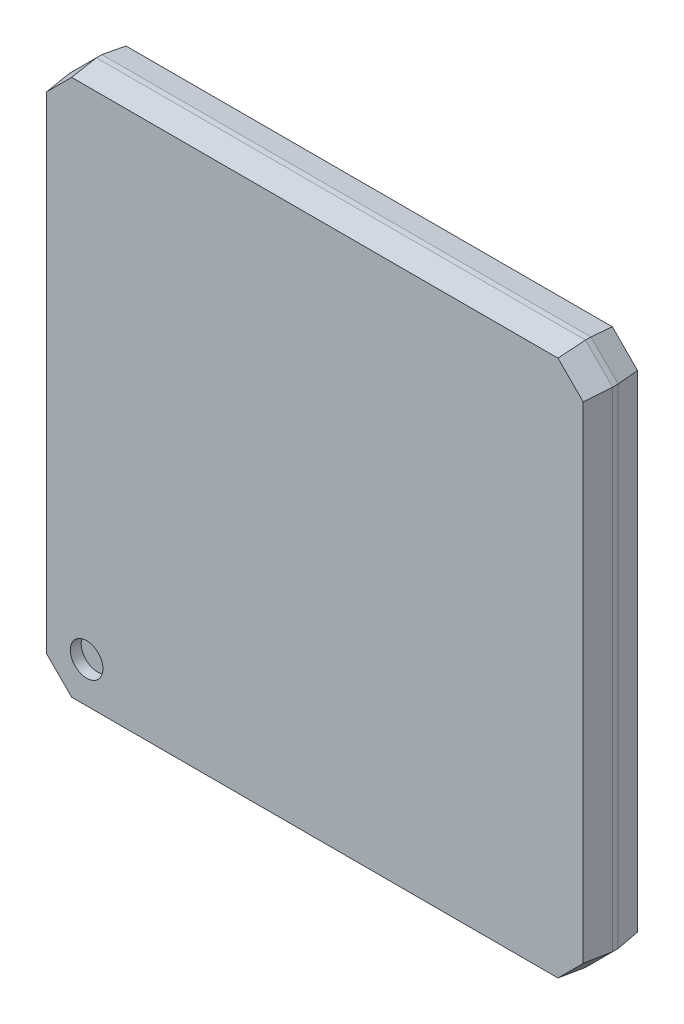
ISO-10303-21;
HEADER;
FILE_DESCRIPTION(('STEP AP214'),'2;1');
FILE_NAME('part.step','',(''),(''),'','','');
FILE_SCHEMA(('AUTOMOTIVE_DESIGN { 1 0 10303 214 1 1 1 1 }'));
ENDSEC;
DATA;
#1=APPLICATION_CONTEXT('core data for automotive mechanical design processes');
#2=APPLICATION_PROTOCOL_DEFINITION('international standard','automotive_design',2000,#1);
#3=PRODUCT_CONTEXT('',#1,'mechanical');
#4=PRODUCT('Part','Part','',(#3));
#5=PRODUCT_RELATED_PRODUCT_CATEGORY('part','',(#4));
#6=PRODUCT_DEFINITION_FORMATION('','',#4);
#7=PRODUCT_DEFINITION_CONTEXT('part definition',#1,'design');
#8=PRODUCT_DEFINITION('design','',#6,#7);
#9=PRODUCT_DEFINITION_SHAPE('','',#8);
#10=(LENGTH_UNIT() NAMED_UNIT(*) SI_UNIT(.MILLI.,.METRE.));
#11=(NAMED_UNIT(*) PLANE_ANGLE_UNIT() SI_UNIT($,.RADIAN.));
#12=(NAMED_UNIT(*) SI_UNIT($,.STERADIAN.) SOLID_ANGLE_UNIT());
#13=UNCERTAINTY_MEASURE_WITH_UNIT(LENGTH_MEASURE(1.E-05),#10,'distance_accuracy_value','');
#14=(GEOMETRIC_REPRESENTATION_CONTEXT(3) GLOBAL_UNCERTAINTY_ASSIGNED_CONTEXT((#13)) GLOBAL_UNIT_ASSIGNED_CONTEXT((#10,
#11,#12)) REPRESENTATION_CONTEXT('',''));
#15=CARTESIAN_POINT('',(0.,0.,0.));
#16=DIRECTION('',(0.,0.,1.));
#17=DIRECTION('',(1.,0.,0.));
#18=AXIS2_PLACEMENT_3D('',#15,#16,#17);
#19=CARTESIAN_POINT('',(1.8,1.8,0.9));
#20=DIRECTION('',(0.,0.,1.));
#21=DIRECTION('',(1.,0.,0.));
#22=AXIS2_PLACEMENT_3D('',#19,#20,#21);
#23=PLANE('',#22);
#24=CARTESIAN_POINT('',(1.8,1.8,0.9));
#25=DIRECTION('',(0.,0.,1.));
#26=DIRECTION('',(1.,0.,0.));
#27=AXIS2_PLACEMENT_3D('',#24,#25,#26);
#28=CIRCLE('',#27,0.300000011921);
#29=CARTESIAN_POINT('',(2.100000011921,1.8,0.9));
#30=VERTEX_POINT('',#29);
#31=EDGE_CURVE('E20',#30,#30,#28,.T.);
#32=ORIENTED_EDGE('',*,*,#31,.T.);
#33=EDGE_LOOP('',(#32));
#34=FACE_BOUND('',#33,.T.);
#35=ADVANCED_FACE('F17',(#34),#23,.T.);
#36=CARTESIAN_POINT('',(1.8,1.8,0.9));
#37=DIRECTION('',(0.,0.,1.));
#38=DIRECTION('',(1.,0.,0.));
#39=AXIS2_PLACEMENT_3D('',#36,#37,#38);
#40=CYLINDRICAL_SURFACE('',#39,0.300000011921);
#41=ORIENTED_EDGE('',*,*,#31,.F.);
#42=EDGE_LOOP('',(#41));
#43=FACE_BOUND('',#42,.T.);
#44=CARTESIAN_POINT('',(1.8,1.8,1.10000000298));
#45=DIRECTION('',(0.,0.,1.));
#46=DIRECTION('',(1.,0.,0.));
#47=AXIS2_PLACEMENT_3D('',#44,#45,#46);
#48=CIRCLE('',#47,0.300000011921);
#49=CARTESIAN_POINT('',(2.100000011921,1.8,1.10000000298));
#50=VERTEX_POINT('',#49);
#51=EDGE_CURVE('E150',#50,#50,#48,.F.);
#52=ORIENTED_EDGE('',*,*,#51,.F.);
#53=EDGE_LOOP('',(#52));
#54=FACE_BOUND('',#53,.T.);
#55=ADVANCED_FACE('F164',(#43,#54),#40,.F.);
#56=CARTESIAN_POINT('',(1.,1.,1.1));
#57=DIRECTION('',(0.,0.,1.));
#58=DIRECTION('',(1.,0.,0.));
#59=AXIS2_PLACEMENT_3D('',#56,#57,#58);
#60=PLANE('',#59);
#61=DIRECTION('',(1.,0.,0.));
#62=VECTOR('',#61,1.);
#63=CARTESIAN_POINT('',(1.5,10.9400000000001,1.10000000000001));
#64=LINE('',#63,#62);
#65=CARTESIAN_POINT('',(1.52485281374214,10.9399999999999,1.09999999999998));
#66=VERTEX_POINT('',#65);
#67=CARTESIAN_POINT('',(10.4751471862579,10.9399999999999,1.09999999999998));
#68=VERTEX_POINT('',#67);
#69=EDGE_CURVE('E131',#66,#68,#64,.T.);
#70=ORIENTED_EDGE('',*,*,#69,.F.);
#71=DIRECTION('',(-0.707106781186548,-0.707106781186548,0.));
#72=VECTOR('',#71,1.);
#73=CARTESIAN_POINT('',(1.10242640687154,10.5175735931285,1.0999999999999));
#74=LINE('',#73,#72);
#75=CARTESIAN_POINT('',(1.06000000000026,10.4751471862577,1.09999999999995));
#76=VERTEX_POINT('',#75);
#77=EDGE_CURVE('E126',#76,#66,#74,.F.);
#78=ORIENTED_EDGE('',*,*,#77,.F.);
#79=DIRECTION('',(0.,1.,0.));
#80=VECTOR('',#79,1.);
#81=CARTESIAN_POINT('',(1.05999999999994,1.5,1.10000000000001));
#82=LINE('',#81,#80);
#83=CARTESIAN_POINT('',(1.06000000000011,1.52485281374214,1.09999999999998));
#84=VERTEX_POINT('',#83);
#85=EDGE_CURVE('E528',#76,#84,#82,.F.);
#86=ORIENTED_EDGE('',*,*,#85,.T.);
#87=DIRECTION('',(-0.707106781186548,0.707106781186548,0.));
#88=VECTOR('',#87,1.);
#89=CARTESIAN_POINT('',(1.10242640687154,1.48242640687154,1.0999999999999));
#90=LINE('',#89,#88);
#91=CARTESIAN_POINT('',(1.52485281374227,1.06000000000026,1.09999999999995));
#92=VERTEX_POINT('',#91);
#93=EDGE_CURVE('E534',#84,#92,#90,.F.);
#94=ORIENTED_EDGE('',*,*,#93,.T.);
#95=DIRECTION('',(1.,0.,0.));
#96=VECTOR('',#95,1.);
#97=CARTESIAN_POINT('',(1.5,1.05999999999994,1.10000000000001));
#98=LINE('',#97,#96);
#99=CARTESIAN_POINT('',(10.4751471862579,1.06000000000012,1.09999999999998));
#100=VERTEX_POINT('',#99);
#101=EDGE_CURVE('E573',#92,#100,#98,.T.);
#102=ORIENTED_EDGE('',*,*,#101,.T.);
#103=DIRECTION('',(0.707106781186548,0.707106781186548,0.));
#104=VECTOR('',#103,1.);
#105=CARTESIAN_POINT('',(10.8975735931285,1.48242640687154,1.0999999999999));
#106=LINE('',#105,#104);
#107=CARTESIAN_POINT('',(10.9399999999999,1.52485281374214,1.09999999999998));
#108=VERTEX_POINT('',#107);
#109=EDGE_CURVE('E571',#108,#100,#106,.F.);
#110=ORIENTED_EDGE('',*,*,#109,.F.);
#111=DIRECTION('',(0.,1.,0.));
#112=VECTOR('',#111,1.);
#113=CARTESIAN_POINT('',(10.9400000000001,1.5,1.10000000000001));
#114=LINE('',#113,#112);
#115=CARTESIAN_POINT('',(10.9399999999997,10.4751471862577,1.09999999999995));
#116=VERTEX_POINT('',#115);
#117=EDGE_CURVE('E146',#116,#108,#114,.F.);
#118=ORIENTED_EDGE('',*,*,#117,.F.);
#119=DIRECTION('',(0.707106781186548,-0.707106781186548,0.));
#120=VECTOR('',#119,1.);
#121=CARTESIAN_POINT('',(10.8975735931285,10.5175735931285,1.0999999999999));
#122=LINE('',#121,#120);
#123=EDGE_CURVE('E140',#116,#68,#122,.F.);
#124=ORIENTED_EDGE('',*,*,#123,.T.);
#125=EDGE_LOOP('',(#70,#78,#86,#94,#102,#110,#118,#124));
#126=FACE_BOUND('',#125,.T.);
#127=ORIENTED_EDGE('',*,*,#51,.T.);
#128=EDGE_LOOP('',(#127));
#129=FACE_BOUND('',#128,.T.);
#130=ADVANCED_FACE('F143',(#126,#129),#60,.T.);
#131=CARTESIAN_POINT('',(10.918786796564,10.538786796564,0.86));
#132=DIRECTION('',(-0.701646415445647,-0.701646415445647,-0.124034734588938));
#133=DIRECTION('',(0.707106781186548,-0.707106781186548,0.));
#134=AXIS2_PLACEMENT_3D('',#131,#132,#133);
#135=PLANE('',#134);
#136=DIRECTION('',(0.05130919646539,0.123871357982886,-0.990970863865105));
#137=VECTOR('',#136,1.);
#138=CARTESIAN_POINT('',(10.475147186258,10.9400000000001,1.10000000000001));
#139=LINE('',#138,#137);
#140=CARTESIAN_POINT('',(10.4999999999998,10.9999999999998,0.61999999999996));
#141=VERTEX_POINT('',#140);
#142=EDGE_CURVE('E136',#68,#141,#139,.T.);
#143=ORIENTED_EDGE('',*,*,#142,.F.);
#144=ORIENTED_EDGE('',*,*,#123,.F.);
#145=DIRECTION('',(-0.123871357982886,-0.05130919646539,0.990970863865105));
#146=VECTOR('',#145,1.);
#147=CARTESIAN_POINT('',(10.9999999999999,10.5,0.619999999999993));
#148=LINE('',#147,#146);
#149=CARTESIAN_POINT('',(10.9999999999998,10.4999999999998,0.61999999999996));
#150=VERTEX_POINT('',#149);
#151=EDGE_CURVE('E567',#150,#116,#148,.T.);
#152=ORIENTED_EDGE('',*,*,#151,.F.);
#153=DIRECTION('',(-0.707106781186548,0.707106781186548,0.));
#154=VECTOR('',#153,1.);
#155=CARTESIAN_POINT('',(10.75,10.75,0.62));
#156=LINE('',#155,#154);
#157=EDGE_CURVE('E153',#141,#150,#156,.F.);
#158=ORIENTED_EDGE('',*,*,#157,.F.);
#159=EDGE_LOOP('',(#143,#144,#152,#158));
#160=FACE_BOUND('',#159,.T.);
#161=ADVANCED_FACE('F152',(#160),#135,.F.);
#162=CARTESIAN_POINT('',(1.5,10.97,0.86));
#163=DIRECTION('',(0.,0.992277876713698,0.124034734588962));
#164=DIRECTION('',(0.,-0.124034734588962,0.992277876713698));
#165=AXIS2_PLACEMENT_3D('',#162,#163,#164);
#166=PLANE('',#165);
#167=ORIENTED_EDGE('',*,*,#69,.T.);
#168=ORIENTED_EDGE('',*,*,#142,.T.);
#169=DIRECTION('',(1.,0.,0.));
#170=VECTOR('',#169,1.);
#171=CARTESIAN_POINT('',(1.,11.,0.62));
#172=LINE('',#171,#170);
#173=CARTESIAN_POINT('',(1.50000000000006,10.9999999999999,0.619999999999987));
#174=VERTEX_POINT('',#173);
#175=EDGE_CURVE('E546',#174,#141,#172,.T.);
#176=ORIENTED_EDGE('',*,*,#175,.F.);
#177=DIRECTION('',(-0.0513091964655928,0.123871357983333,-0.990970863865038));
#178=VECTOR('',#177,1.);
#179=CARTESIAN_POINT('',(1.52485281374254,10.9399999999995,1.0999999999999));
#180=LINE('',#179,#178);
#181=EDGE_CURVE('E138',#66,#174,#180,.T.);
#182=ORIENTED_EDGE('',*,*,#181,.F.);
#183=EDGE_LOOP('',(#167,#168,#176,#182));
#184=FACE_BOUND('',#183,.T.);
#185=ADVANCED_FACE('F133',(#184),#166,.T.);
#186=CARTESIAN_POINT('',(1.081213203436,10.538786796564,0.86));
#187=DIRECTION('',(-0.701646415445647,0.701646415445647,0.124034734588938));
#188=DIRECTION('',(-0.707106781186548,-0.707106781186548,0.));
#189=AXIS2_PLACEMENT_3D('',#186,#187,#188);
#190=PLANE('',#189);
#191=ORIENTED_EDGE('',*,*,#77,.T.);
#192=ORIENTED_EDGE('',*,*,#181,.T.);
#193=DIRECTION('',(0.707106781186548,0.707106781186548,0.));
#194=VECTOR('',#193,1.);
#195=CARTESIAN_POINT('',(1.25,10.75,0.62));
#196=LINE('',#195,#194);
#197=CARTESIAN_POINT('',(1.00000000000024,10.4999999999998,0.619999999999959));
#198=VERTEX_POINT('',#197);
#199=EDGE_CURVE('E544',#174,#198,#196,.F.);
#200=ORIENTED_EDGE('',*,*,#199,.T.);
#201=DIRECTION('',(0.123871357982888,-0.05130919646539,0.990970863865104));
#202=VECTOR('',#201,1.);
#203=CARTESIAN_POINT('',(1.00000000000006,10.5,0.619999999999993));
#204=LINE('',#203,#202);
#205=EDGE_CURVE('E538',#198,#76,#204,.T.);
#206=ORIENTED_EDGE('',*,*,#205,.T.);
#207=EDGE_LOOP('',(#191,#192,#200,#206));
#208=FACE_BOUND('',#207,.T.);
#209=ADVANCED_FACE('F263',(#208),#190,.T.);
#210=CARTESIAN_POINT('',(1.03,1.5,0.86));
#211=DIRECTION('',(0.992277876713698,0.,-0.124034734588962));
#212=DIRECTION('',(-0.124034734588962,0.,-0.992277876713698));
#213=AXIS2_PLACEMENT_3D('',#210,#211,#212);
#214=PLANE('',#213);
#215=DIRECTION('',(0.123871357983335,0.0513091964655914,0.990970863865038));
#216=VECTOR('',#215,1.);
#217=CARTESIAN_POINT('',(1.00000000000044,1.50000000000044,0.619999999999922));
#218=LINE('',#217,#216);
#219=CARTESIAN_POINT('',(1.00000000000009,1.50000000000006,0.619999999999986));
#220=VERTEX_POINT('',#219);
#221=EDGE_CURVE('E527',#220,#84,#218,.T.);
#222=ORIENTED_EDGE('',*,*,#221,.T.);
#223=ORIENTED_EDGE('',*,*,#85,.F.);
#224=ORIENTED_EDGE('',*,*,#205,.F.);
#225=DIRECTION('',(0.,1.,0.));
#226=VECTOR('',#225,1.);
#227=CARTESIAN_POINT('',(1.,1.,0.62));
#228=LINE('',#227,#226);
#229=EDGE_CURVE('E530',#198,#220,#228,.F.);
#230=ORIENTED_EDGE('',*,*,#229,.T.);
#231=EDGE_LOOP('',(#222,#223,#224,#230));
#232=FACE_BOUND('',#231,.T.);
#233=ADVANCED_FACE('F259',(#232),#214,.F.);
#234=CARTESIAN_POINT('',(1.081213203436,1.461213203436,0.86));
#235=DIRECTION('',(0.701646415445647,0.701646415445647,-0.124034734588938));
#236=DIRECTION('',(-0.707106781186548,0.707106781186548,0.));
#237=AXIS2_PLACEMENT_3D('',#234,#235,#236);
#238=PLANE('',#237);
#239=DIRECTION('',(0.0513091964653909,0.123871357982888,0.990970863865104));
#240=VECTOR('',#239,1.);
#241=CARTESIAN_POINT('',(1.5,1.00000000000006,0.619999999999993));
#242=LINE('',#241,#240);
#243=CARTESIAN_POINT('',(1.50000000000022,1.00000000000023,0.61999999999996));
#244=VERTEX_POINT('',#243);
#245=EDGE_CURVE('E536',#244,#92,#242,.T.);
#246=ORIENTED_EDGE('',*,*,#245,.T.);
#247=ORIENTED_EDGE('',*,*,#93,.F.);
#248=ORIENTED_EDGE('',*,*,#221,.F.);
#249=DIRECTION('',(0.707106781186548,-0.707106781186548,0.));
#250=VECTOR('',#249,1.);
#251=CARTESIAN_POINT('',(1.25,1.25,0.62));
#252=LINE('',#251,#250);
#253=EDGE_CURVE('E576',#244,#220,#252,.F.);
#254=ORIENTED_EDGE('',*,*,#253,.F.);
#255=EDGE_LOOP('',(#246,#247,#248,#254));
#256=FACE_BOUND('',#255,.T.);
#257=ADVANCED_FACE('F255',(#256),#238,.F.);
#258=CARTESIAN_POINT('',(1.5,1.03,0.86));
#259=DIRECTION('',(0.,0.992277876713698,-0.124034734588962));
#260=DIRECTION('',(0.,0.124034734588962,0.992277876713698));
#261=AXIS2_PLACEMENT_3D('',#258,#259,#260);
#262=PLANE('',#261);
#263=DIRECTION('',(0.0513091964655905,-0.123871357983335,-0.990970863865038));
#264=VECTOR('',#263,1.);
#265=CARTESIAN_POINT('',(10.4751471862575,1.06000000000054,1.0999999999999));
#266=LINE('',#265,#264);
#267=CARTESIAN_POINT('',(10.4999999999999,1.00000000000009,0.619999999999986));
#268=VERTEX_POINT('',#267);
#269=EDGE_CURVE('E569',#100,#268,#266,.T.);
#270=ORIENTED_EDGE('',*,*,#269,.F.);
#271=ORIENTED_EDGE('',*,*,#101,.F.);
#272=ORIENTED_EDGE('',*,*,#245,.F.);
#273=DIRECTION('',(1.,0.,0.));
#274=VECTOR('',#273,1.);
#275=CARTESIAN_POINT('',(1.,1.,0.62));
#276=LINE('',#275,#274);
#277=EDGE_CURVE('E581',#244,#268,#276,.T.);
#278=ORIENTED_EDGE('',*,*,#277,.T.);
#279=EDGE_LOOP('',(#270,#271,#272,#278));
#280=FACE_BOUND('',#279,.T.);
#281=ADVANCED_FACE('F251',(#280),#262,.F.);
#282=CARTESIAN_POINT('',(10.918786796564,1.461213203436,0.86));
#283=DIRECTION('',(0.701646415445647,-0.701646415445647,0.124034734588938));
#284=DIRECTION('',(0.707106781186548,0.707106781186548,0.));
#285=AXIS2_PLACEMENT_3D('',#282,#283,#284);
#286=PLANE('',#285);
#287=ORIENTED_EDGE('',*,*,#109,.T.);
#288=ORIENTED_EDGE('',*,*,#269,.T.);
#289=DIRECTION('',(-0.707106781186548,-0.707106781186548,0.));
#290=VECTOR('',#289,1.);
#291=CARTESIAN_POINT('',(10.75,1.25,0.62));
#292=LINE('',#291,#290);
#293=CARTESIAN_POINT('',(10.9999999999998,1.50000000000022,0.619999999999959));
#294=VERTEX_POINT('',#293);
#295=EDGE_CURVE('E585',#268,#294,#292,.F.);
#296=ORIENTED_EDGE('',*,*,#295,.T.);
#297=DIRECTION('',(0.123871357982886,-0.0513091964653909,-0.990970863865105));
#298=VECTOR('',#297,1.);
#299=CARTESIAN_POINT('',(10.9400000000001,1.524852813742,1.10000000000001));
#300=LINE('',#299,#298);
#301=EDGE_CURVE('E564',#108,#294,#300,.T.);
#302=ORIENTED_EDGE('',*,*,#301,.F.);
#303=EDGE_LOOP('',(#287,#288,#296,#302));
#304=FACE_BOUND('',#303,.T.);
#305=ADVANCED_FACE('F247',(#304),#286,.T.);
#306=CARTESIAN_POINT('',(10.97,1.5,0.86));
#307=DIRECTION('',(0.992277876713698,0.,0.124034734588962));
#308=DIRECTION('',(0.124034734588962,0.,-0.992277876713698));
#309=AXIS2_PLACEMENT_3D('',#306,#307,#308);
#310=PLANE('',#309);
#311=ORIENTED_EDGE('',*,*,#301,.T.);
#312=DIRECTION('',(0.,1.,0.));
#313=VECTOR('',#312,1.);
#314=CARTESIAN_POINT('',(11.,1.,0.62));
#315=LINE('',#314,#313);
#316=EDGE_CURVE('E589',#150,#294,#315,.F.);
#317=ORIENTED_EDGE('',*,*,#316,.F.);
#318=ORIENTED_EDGE('',*,*,#151,.T.);
#319=ORIENTED_EDGE('',*,*,#117,.T.);
#320=EDGE_LOOP('',(#311,#317,#318,#319));
#321=FACE_BOUND('',#320,.T.);
#322=ADVANCED_FACE('F243',(#321),#310,.T.);
#323=CARTESIAN_POINT('',(10.75,10.75,0.1));
#324=DIRECTION('',(0.707106781186548,0.707106781186548,0.));
#325=DIRECTION('',(-0.707106781186548,0.707106781186548,0.));
#326=AXIS2_PLACEMENT_3D('',#323,#324,#325);
#327=PLANE('',#326);
#328=DIRECTION('',(0.,0.,1.));
#329=VECTOR('',#328,1.);
#330=CARTESIAN_POINT('',(10.5,11.,0.1));
#331=LINE('',#330,#329);
#332=CARTESIAN_POINT('',(10.4999999999999,10.9999999999999,0.520000000000023));
#333=VERTEX_POINT('',#332);
#334=EDGE_CURVE('E550',#141,#333,#331,.F.);
#335=ORIENTED_EDGE('',*,*,#334,.F.);
#336=ORIENTED_EDGE('',*,*,#157,.T.);
#337=DIRECTION('',(0.,0.,-1.));
#338=VECTOR('',#337,1.);
#339=CARTESIAN_POINT('',(11.,10.5,0.1));
#340=LINE('',#339,#338);
#341=CARTESIAN_POINT('',(10.9999999999999,10.4999999999999,0.520000000000012));
#342=VERTEX_POINT('',#341);
#343=EDGE_CURVE('E595',#342,#150,#340,.F.);
#344=ORIENTED_EDGE('',*,*,#343,.F.);
#345=DIRECTION('',(-0.707106781186547,0.707106781186547,0.));
#346=VECTOR('',#345,1.);
#347=CARTESIAN_POINT('',(10.9399999999996,10.5599999999996,0.520000000000089));
#348=LINE('',#347,#346);
#349=EDGE_CURVE('E597',#333,#342,#348,.F.);
#350=ORIENTED_EDGE('',*,*,#349,.F.);
#351=EDGE_LOOP('',(#335,#336,#344,#350));
#352=FACE_BOUND('',#351,.T.);
#353=ADVANCED_FACE('F239',(#352),#327,.T.);
#354=CARTESIAN_POINT('',(1.,11.,0.1));
#355=DIRECTION('',(0.,1.,0.));
#356=DIRECTION('',(0.,0.,1.));
#357=AXIS2_PLACEMENT_3D('',#354,#355,#356);
#358=PLANE('',#357);
#359=DIRECTION('',(0.,0.,1.));
#360=VECTOR('',#359,1.);
#361=CARTESIAN_POINT('',(1.5,11.,0.1));
#362=LINE('',#361,#360);
#363=CARTESIAN_POINT('',(1.50000000000005,10.9999999999999,0.520000000000013));
#364=VERTEX_POINT('',#363);
#365=EDGE_CURVE('E549',#364,#174,#362,.T.);
#366=ORIENTED_EDGE('',*,*,#365,.T.);
#367=ORIENTED_EDGE('',*,*,#175,.T.);
#368=ORIENTED_EDGE('',*,*,#334,.T.);
#369=DIRECTION('',(1.,0.,0.));
#370=VECTOR('',#369,1.);
#371=CARTESIAN_POINT('',(1.5,10.9999999999999,0.520000000000008));
#372=LINE('',#371,#370);
#373=EDGE_CURVE('E557',#333,#364,#372,.F.);
#374=ORIENTED_EDGE('',*,*,#373,.T.);
#375=EDGE_LOOP('',(#366,#367,#368,#374));
#376=FACE_BOUND('',#375,.T.);
#377=ADVANCED_FACE('F235',(#376),#358,.T.);
#378=CARTESIAN_POINT('',(1.25,10.75,0.1));
#379=DIRECTION('',(0.707106781186548,-0.707106781186548,0.));
#380=DIRECTION('',(0.707106781186548,0.707106781186548,0.));
#381=AXIS2_PLACEMENT_3D('',#378,#379,#380);
#382=PLANE('',#381);
#383=ORIENTED_EDGE('',*,*,#199,.F.);
#384=ORIENTED_EDGE('',*,*,#365,.F.);
#385=DIRECTION('',(0.707106781186547,0.707106781186547,0.));
#386=VECTOR('',#385,1.);
#387=CARTESIAN_POINT('',(1.06000000000044,10.5599999999996,0.520000000000089));
#388=LINE('',#387,#386);
#389=CARTESIAN_POINT('',(1.00000000000006,10.4999999999999,0.520000000000012));
#390=VERTEX_POINT('',#389);
#391=EDGE_CURVE('E629',#364,#390,#388,.F.);
#392=ORIENTED_EDGE('',*,*,#391,.T.);
#393=DIRECTION('',(0.,0.,-1.));
#394=VECTOR('',#393,1.);
#395=CARTESIAN_POINT('',(1.,10.5,0.1));
#396=LINE('',#395,#394);
#397=EDGE_CURVE('E554',#390,#198,#396,.F.);
#398=ORIENTED_EDGE('',*,*,#397,.T.);
#399=EDGE_LOOP('',(#383,#384,#392,#398));
#400=FACE_BOUND('',#399,.T.);
#401=ADVANCED_FACE('F231',(#400),#382,.F.);
#402=CARTESIAN_POINT('',(1.,1.,0.1));
#403=DIRECTION('',(1.,0.,0.));
#404=DIRECTION('',(0.,0.,-1.));
#405=AXIS2_PLACEMENT_3D('',#402,#403,#404);
#406=PLANE('',#405);
#407=DIRECTION('',(0.,1.,0.));
#408=VECTOR('',#407,1.);
#409=CARTESIAN_POINT('',(1.00000000000006,1.5,0.520000000000009));
#410=LINE('',#409,#408);
#411=CARTESIAN_POINT('',(1.00000000000006,1.50000000000006,0.520000000000012));
#412=VERTEX_POINT('',#411);
#413=EDGE_CURVE('E628',#412,#390,#410,.T.);
#414=ORIENTED_EDGE('',*,*,#413,.F.);
#415=DIRECTION('',(0.,0.,1.));
#416=VECTOR('',#415,1.);
#417=CARTESIAN_POINT('',(1.,1.5,0.1));
#418=LINE('',#417,#416);
#419=EDGE_CURVE('E611',#220,#412,#418,.F.);
#420=ORIENTED_EDGE('',*,*,#419,.F.);
#421=ORIENTED_EDGE('',*,*,#229,.F.);
#422=ORIENTED_EDGE('',*,*,#397,.F.);
#423=EDGE_LOOP('',(#414,#420,#421,#422));
#424=FACE_BOUND('',#423,.T.);
#425=ADVANCED_FACE('F227',(#424),#406,.F.);
#426=CARTESIAN_POINT('',(1.25,1.25,0.1));
#427=DIRECTION('',(-0.707106781186548,-0.707106781186548,0.));
#428=DIRECTION('',(0.707106781186548,-0.707106781186548,0.));
#429=AXIS2_PLACEMENT_3D('',#426,#427,#428);
#430=PLANE('',#429);
#431=DIRECTION('',(0.,0.,1.));
#432=VECTOR('',#431,1.);
#433=CARTESIAN_POINT('',(1.5,1.,0.1));
#434=LINE('',#433,#432);
#435=CARTESIAN_POINT('',(1.50000000000011,1.00000000000012,0.520000000000023));
#436=VERTEX_POINT('',#435);
#437=EDGE_CURVE('E607',#436,#244,#434,.T.);
#438=ORIENTED_EDGE('',*,*,#437,.T.);
#439=ORIENTED_EDGE('',*,*,#253,.T.);
#440=ORIENTED_EDGE('',*,*,#419,.T.);
#441=DIRECTION('',(0.707106781186547,-0.707106781186547,0.));
#442=VECTOR('',#441,1.);
#443=CARTESIAN_POINT('',(1.06000000000044,1.44000000000044,0.520000000000089));
#444=LINE('',#443,#442);
#445=EDGE_CURVE('E616',#436,#412,#444,.F.);
#446=ORIENTED_EDGE('',*,*,#445,.F.);
#447=EDGE_LOOP('',(#438,#439,#440,#446));
#448=FACE_BOUND('',#447,.T.);
#449=ADVANCED_FACE('F223',(#448),#430,.T.);
#450=CARTESIAN_POINT('',(1.,1.,0.1));
#451=DIRECTION('',(0.,1.,0.));
#452=DIRECTION('',(0.,0.,1.));
#453=AXIS2_PLACEMENT_3D('',#450,#451,#452);
#454=PLANE('',#453);
#455=ORIENTED_EDGE('',*,*,#277,.F.);
#456=ORIENTED_EDGE('',*,*,#437,.F.);
#457=DIRECTION('',(1.,0.,0.));
#458=VECTOR('',#457,1.);
#459=CARTESIAN_POINT('',(1.5,1.00000000000006,0.520000000000009));
#460=LINE('',#459,#458);
#461=CARTESIAN_POINT('',(10.4999999999999,1.00000000000006,0.520000000000012));
#462=VERTEX_POINT('',#461);
#463=EDGE_CURVE('E635',#462,#436,#460,.F.);
#464=ORIENTED_EDGE('',*,*,#463,.F.);
#465=DIRECTION('',(0.,0.,1.));
#466=VECTOR('',#465,1.);
#467=CARTESIAN_POINT('',(10.5,1.,0.1));
#468=LINE('',#467,#466);
#469=EDGE_CURVE('E603',#462,#268,#468,.T.);
#470=ORIENTED_EDGE('',*,*,#469,.T.);
#471=EDGE_LOOP('',(#455,#456,#464,#470));
#472=FACE_BOUND('',#471,.T.);
#473=ADVANCED_FACE('F219',(#472),#454,.F.);
#474=CARTESIAN_POINT('',(10.75,1.25,0.1));
#475=DIRECTION('',(-0.707106781186548,0.707106781186548,0.));
#476=DIRECTION('',(-0.707106781186548,-0.707106781186548,0.));
#477=AXIS2_PLACEMENT_3D('',#474,#475,#476);
#478=PLANE('',#477);
#479=ORIENTED_EDGE('',*,*,#295,.F.);
#480=ORIENTED_EDGE('',*,*,#469,.F.);
#481=DIRECTION('',(-0.707106781186547,-0.707106781186547,0.));
#482=VECTOR('',#481,1.);
#483=CARTESIAN_POINT('',(10.9399999999996,1.44000000000044,0.520000000000089));
#484=LINE('',#483,#482);
#485=CARTESIAN_POINT('',(10.9999999999999,1.50000000000011,0.520000000000023));
#486=VERTEX_POINT('',#485);
#487=EDGE_CURVE('E662',#462,#486,#484,.F.);
#488=ORIENTED_EDGE('',*,*,#487,.T.);
#489=DIRECTION('',(0.,0.,-1.));
#490=VECTOR('',#489,1.);
#491=CARTESIAN_POINT('',(11.,1.5,0.1));
#492=LINE('',#491,#490);
#493=EDGE_CURVE('E592',#294,#486,#492,.T.);
#494=ORIENTED_EDGE('',*,*,#493,.F.);
#495=EDGE_LOOP('',(#479,#480,#488,#494));
#496=FACE_BOUND('',#495,.T.);
#497=ADVANCED_FACE('F215',(#496),#478,.F.);
#498=CARTESIAN_POINT('',(11.,1.,0.1));
#499=DIRECTION('',(1.,0.,0.));
#500=DIRECTION('',(0.,0.,-1.));
#501=AXIS2_PLACEMENT_3D('',#498,#499,#500);
#502=PLANE('',#501);
#503=ORIENTED_EDGE('',*,*,#493,.T.);
#504=DIRECTION('',(0.,1.,0.));
#505=VECTOR('',#504,1.);
#506=CARTESIAN_POINT('',(10.9999999999999,1.5,0.520000000000008));
#507=LINE('',#506,#505);
#508=EDGE_CURVE('E652',#486,#342,#507,.T.);
#509=ORIENTED_EDGE('',*,*,#508,.T.);
#510=ORIENTED_EDGE('',*,*,#343,.T.);
#511=ORIENTED_EDGE('',*,*,#316,.T.);
#512=EDGE_LOOP('',(#503,#509,#510,#511));
#513=FACE_BOUND('',#512,.T.);
#514=ADVANCED_FACE('F211',(#513),#502,.T.);
#515=CARTESIAN_POINT('',(10.918786796564,10.538786796564,0.31));
#516=DIRECTION('',(0.700000000000031,0.700000000000031,-0.141421356237006));
#517=DIRECTION('',(-0.707106781186547,0.707106781186547,0.));
#518=AXIS2_PLACEMENT_3D('',#515,#516,#517);
#519=PLANE('',#518);
#520=DIRECTION('',(-0.141179338227996,-0.0584783966201034,-0.988255367597994));
#521=VECTOR('',#520,1.);
#522=CARTESIAN_POINT('',(10.9999999999999,10.5,0.520000000000008));
#523=LINE('',#522,#521);
#524=CARTESIAN_POINT('',(10.9399999999997,10.4751471862577,0.100000000000052));
#525=VERTEX_POINT('',#524);
#526=EDGE_CURVE('E651',#342,#525,#523,.T.);
#527=ORIENTED_EDGE('',*,*,#526,.T.);
#528=DIRECTION('',(-0.707106781186548,0.707106781186548,0.));
#529=VECTOR('',#528,1.);
#530=CARTESIAN_POINT('',(10.94,10.475147186258,0.1));
#531=LINE('',#530,#529);
#532=CARTESIAN_POINT('',(10.4751471862577,10.9399999999997,0.100000000000052));
#533=VERTEX_POINT('',#532);
#534=EDGE_CURVE('E653',#525,#533,#531,.T.);
#535=ORIENTED_EDGE('',*,*,#534,.T.);
#536=DIRECTION('',(0.0584783966201034,0.141179338227996,0.988255367597994));
#537=VECTOR('',#536,1.);
#538=CARTESIAN_POINT('',(10.475147186258,10.9400000000001,0.0999999999999916));
#539=LINE('',#538,#537);
#540=EDGE_CURVE('E645',#533,#333,#539,.T.);
#541=ORIENTED_EDGE('',*,*,#540,.T.);
#542=ORIENTED_EDGE('',*,*,#349,.T.);
#543=EDGE_LOOP('',(#527,#535,#541,#542));
#544=FACE_BOUND('',#543,.T.);
#545=ADVANCED_FACE('F207',(#544),#519,.T.);
#546=CARTESIAN_POINT('',(1.5,10.97,0.31));
#547=DIRECTION('',(0.,-0.989949493661207,0.14142135623703));
#548=DIRECTION('',(0.,-0.14142135623703,-0.989949493661207));
#549=AXIS2_PLACEMENT_3D('',#546,#547,#548);
#550=PLANE('',#549);
#551=ORIENTED_EDGE('',*,*,#540,.F.);
#552=DIRECTION('',(1.,0.,0.));
#553=VECTOR('',#552,1.);
#554=CARTESIAN_POINT('',(1.,10.94,0.1));
#555=LINE('',#554,#553);
#556=CARTESIAN_POINT('',(1.52485281374213,10.9399999999999,0.100000000000023));
#557=VERTEX_POINT('',#556);
#558=EDGE_CURVE('E678',#533,#557,#555,.F.);
#559=ORIENTED_EDGE('',*,*,#558,.T.);
#560=DIRECTION('',(-0.0584783966203344,0.14117933822851,0.988255367597907));
#561=VECTOR('',#560,1.);
#562=CARTESIAN_POINT('',(1.52485281374254,10.9399999999995,0.100000000000109));
#563=LINE('',#562,#561);
#564=EDGE_CURVE('E641',#557,#364,#563,.T.);
#565=ORIENTED_EDGE('',*,*,#564,.T.);
#566=ORIENTED_EDGE('',*,*,#373,.F.);
#567=EDGE_LOOP('',(#551,#559,#565,#566));
#568=FACE_BOUND('',#567,.T.);
#569=ADVANCED_FACE('F203',(#568),#550,.F.);
#570=CARTESIAN_POINT('',(1.081213203436,10.538786796564,0.31));
#571=DIRECTION('',(0.700000000000031,-0.700000000000031,0.141421356237006));
#572=DIRECTION('',(0.707106781186547,0.707106781186547,0.));
#573=AXIS2_PLACEMENT_3D('',#570,#571,#572);
#574=PLANE('',#573);
#575=ORIENTED_EDGE('',*,*,#564,.F.);
#576=DIRECTION('',(-0.707106781186548,-0.707106781186547,0.));
#577=VECTOR('',#576,1.);
#578=CARTESIAN_POINT('',(1.524852813742,10.94,0.1));
#579=LINE('',#578,#577);
#580=CARTESIAN_POINT('',(1.06000000000025,10.4751471862577,0.100000000000052));
#581=VERTEX_POINT('',#580);
#582=EDGE_CURVE('E675',#557,#581,#579,.T.);
#583=ORIENTED_EDGE('',*,*,#582,.T.);
#584=DIRECTION('',(0.141179338228,-0.0584783966201033,-0.988255367597994));
#585=VECTOR('',#584,1.);
#586=CARTESIAN_POINT('',(1.00000000000006,10.5,0.520000000000009));
#587=LINE('',#586,#585);
#588=EDGE_CURVE('E625',#390,#581,#587,.T.);
#589=ORIENTED_EDGE('',*,*,#588,.F.);
#590=ORIENTED_EDGE('',*,*,#391,.F.);
#591=EDGE_LOOP('',(#575,#583,#589,#590));
#592=FACE_BOUND('',#591,.T.);
#593=ADVANCED_FACE('F199',(#592),#574,.F.);
#594=CARTESIAN_POINT('',(1.03,1.5,0.31));
#595=DIRECTION('',(-0.989949493661207,0.,-0.14142135623703));
#596=DIRECTION('',(-0.14142135623703,0.,0.989949493661207));
#597=AXIS2_PLACEMENT_3D('',#594,#595,#596);
#598=PLANE('',#597);
#599=DIRECTION('',(0.,1.,0.));
#600=VECTOR('',#599,1.);
#601=CARTESIAN_POINT('',(1.06,1.,0.1));
#602=LINE('',#601,#600);
#603=CARTESIAN_POINT('',(1.06000000000011,1.52485281374213,0.100000000000023));
#604=VERTEX_POINT('',#603);
#605=EDGE_CURVE('E633',#581,#604,#602,.F.);
#606=ORIENTED_EDGE('',*,*,#605,.T.);
#607=DIRECTION('',(0.14117933822851,0.0584783966203344,-0.988255367597907));
#608=VECTOR('',#607,1.);
#609=CARTESIAN_POINT('',(1.00000000000044,1.50000000000044,0.520000000000089));
#610=LINE('',#609,#608);
#611=EDGE_CURVE('E622',#412,#604,#610,.T.);
#612=ORIENTED_EDGE('',*,*,#611,.F.);
#613=ORIENTED_EDGE('',*,*,#413,.T.);
#614=ORIENTED_EDGE('',*,*,#588,.T.);
#615=EDGE_LOOP('',(#606,#612,#613,#614));
#616=FACE_BOUND('',#615,.T.);
#617=ADVANCED_FACE('F195',(#616),#598,.T.);
#618=CARTESIAN_POINT('',(1.081213203436,1.461213203436,0.31));
#619=DIRECTION('',(-0.700000000000031,-0.700000000000031,-0.141421356237006));
#620=DIRECTION('',(0.707106781186547,-0.707106781186547,0.));
#621=AXIS2_PLACEMENT_3D('',#618,#619,#620);
#622=PLANE('',#621);
#623=ORIENTED_EDGE('',*,*,#611,.T.);
#624=DIRECTION('',(0.707106781186548,-0.707106781186548,0.));
#625=VECTOR('',#624,1.);
#626=CARTESIAN_POINT('',(1.06,1.524852813742,0.1));
#627=LINE('',#626,#625);
#628=CARTESIAN_POINT('',(1.52485281374227,1.06000000000025,0.100000000000052));
#629=VERTEX_POINT('',#628);
#630=EDGE_CURVE('E670',#604,#629,#627,.T.);
#631=ORIENTED_EDGE('',*,*,#630,.T.);
#632=DIRECTION('',(0.0584783966201043,0.141179338228,-0.988255367597994));
#633=VECTOR('',#632,1.);
#634=CARTESIAN_POINT('',(1.5,1.00000000000006,0.520000000000009));
#635=LINE('',#634,#633);
#636=EDGE_CURVE('E624',#436,#629,#635,.T.);
#637=ORIENTED_EDGE('',*,*,#636,.F.);
#638=ORIENTED_EDGE('',*,*,#445,.T.);
#639=EDGE_LOOP('',(#623,#631,#637,#638));
#640=FACE_BOUND('',#639,.T.);
#641=ADVANCED_FACE('F191',(#640),#622,.T.);
#642=CARTESIAN_POINT('',(1.5,1.03,0.31));
#643=DIRECTION('',(0.,-0.989949493661207,-0.14142135623703));
#644=DIRECTION('',(0.,0.14142135623703,-0.989949493661207));
#645=AXIS2_PLACEMENT_3D('',#642,#643,#644);
#646=PLANE('',#645);
#647=DIRECTION('',(0.0584783966203319,-0.141179338228509,0.988255367597907));
#648=VECTOR('',#647,1.);
#649=CARTESIAN_POINT('',(10.4751471862575,1.06000000000054,0.100000000000109));
#650=LINE('',#649,#648);
#651=CARTESIAN_POINT('',(10.4751471862579,1.06000000000011,0.100000000000023));
#652=VERTEX_POINT('',#651);
#653=EDGE_CURVE('E656',#652,#462,#650,.T.);
#654=ORIENTED_EDGE('',*,*,#653,.T.);
#655=ORIENTED_EDGE('',*,*,#463,.T.);
#656=ORIENTED_EDGE('',*,*,#636,.T.);
#657=DIRECTION('',(1.,0.,0.));
#658=VECTOR('',#657,1.);
#659=CARTESIAN_POINT('',(1.,1.06,0.1));
#660=LINE('',#659,#658);
#661=EDGE_CURVE('E668',#629,#652,#660,.T.);
#662=ORIENTED_EDGE('',*,*,#661,.T.);
#663=EDGE_LOOP('',(#654,#655,#656,#662));
#664=FACE_BOUND('',#663,.T.);
#665=ADVANCED_FACE('F187',(#664),#646,.T.);
#666=CARTESIAN_POINT('',(10.918786796564,1.461213203436,0.31));
#667=DIRECTION('',(-0.700000000000031,0.700000000000031,0.141421356237006));
#668=DIRECTION('',(-0.707106781186547,-0.707106781186547,0.));
#669=AXIS2_PLACEMENT_3D('',#666,#667,#668);
#670=PLANE('',#669);
#671=DIRECTION('',(0.707106781186547,0.707106781186548,0.));
#672=VECTOR('',#671,1.);
#673=CARTESIAN_POINT('',(10.475147186258,1.06,0.1));
#674=LINE('',#673,#672);
#675=CARTESIAN_POINT('',(10.9399999999997,1.52485281374227,0.100000000000052));
#676=VERTEX_POINT('',#675);
#677=EDGE_CURVE('E26',#652,#676,#674,.T.);
#678=ORIENTED_EDGE('',*,*,#677,.T.);
#679=DIRECTION('',(0.141179338227996,-0.0584783966201044,0.988255367597994));
#680=VECTOR('',#679,1.);
#681=CARTESIAN_POINT('',(10.9400000000001,1.524852813742,0.0999999999999916));
#682=LINE('',#681,#680);
#683=EDGE_CURVE('E34',#676,#486,#682,.T.);
#684=ORIENTED_EDGE('',*,*,#683,.T.);
#685=ORIENTED_EDGE('',*,*,#487,.F.);
#686=ORIENTED_EDGE('',*,*,#653,.F.);
#687=EDGE_LOOP('',(#678,#684,#685,#686));
#688=FACE_BOUND('',#687,.T.);
#689=ADVANCED_FACE('F181',(#688),#670,.F.);
#690=CARTESIAN_POINT('',(10.97,1.5,0.31));
#691=DIRECTION('',(-0.989949493661207,0.,0.14142135623703));
#692=DIRECTION('',(0.14142135623703,0.,0.989949493661207));
#693=AXIS2_PLACEMENT_3D('',#690,#691,#692);
#694=PLANE('',#693);
#695=ORIENTED_EDGE('',*,*,#508,.F.);
#696=ORIENTED_EDGE('',*,*,#683,.F.);
#697=DIRECTION('',(0.,1.,0.));
#698=VECTOR('',#697,1.);
#699=CARTESIAN_POINT('',(10.94,1.,0.1));
#700=LINE('',#699,#698);
#701=EDGE_CURVE('E11',#676,#525,#700,.T.);
#702=ORIENTED_EDGE('',*,*,#701,.T.);
#703=ORIENTED_EDGE('',*,*,#526,.F.);
#704=EDGE_LOOP('',(#695,#696,#702,#703));
#705=FACE_BOUND('',#704,.T.);
#706=ADVANCED_FACE('F175',(#705),#694,.F.);
#707=CARTESIAN_POINT('',(1.,1.,0.1));
#708=DIRECTION('',(0.,0.,1.));
#709=DIRECTION('',(1.,0.,0.));
#710=AXIS2_PLACEMENT_3D('',#707,#708,#709);
#711=PLANE('',#710);
#712=ORIENTED_EDGE('',*,*,#677,.F.);
#713=ORIENTED_EDGE('',*,*,#661,.F.);
#714=ORIENTED_EDGE('',*,*,#630,.F.);
#715=ORIENTED_EDGE('',*,*,#605,.F.);
#716=ORIENTED_EDGE('',*,*,#582,.F.);
#717=ORIENTED_EDGE('',*,*,#558,.F.);
#718=ORIENTED_EDGE('',*,*,#534,.F.);
#719=ORIENTED_EDGE('',*,*,#701,.F.);
#720=EDGE_LOOP('',(#712,#713,#714,#715,#716,#717,#718,#719));
#721=FACE_BOUND('',#720,.T.);
#722=ADVANCED_FACE('F173',(#721),#711,.F.);
#723=CLOSED_SHELL('',(#35,#55,#130,#161,#185,#209,#233,#257,#281,#305,#322,#353,#377,#401,#425,
#449,#473,#497,#514,#545,#569,#593,#617,#641,#665,#689,#706,#722));
#724=MANIFOLD_SOLID_BREP('B1',#723);
#725=ADVANCED_BREP_SHAPE_REPRESENTATION('',(#18,#724),#14);
#726=SHAPE_DEFINITION_REPRESENTATION(#9,#725);
ENDSEC;
END-ISO-10303-21;
